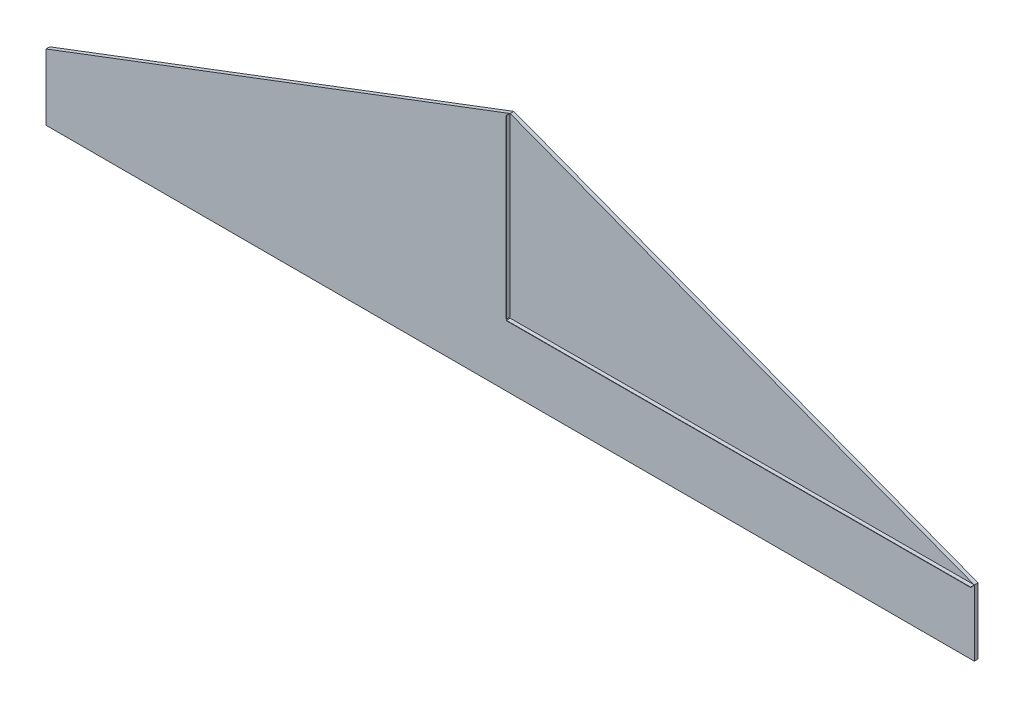
ISO-10303-21;
HEADER;
FILE_DESCRIPTION(('STEP AP214'),'2;1');
FILE_NAME('part.step','',(''),(''),'','','');
FILE_SCHEMA(('AUTOMOTIVE_DESIGN { 1 0 10303 214 1 1 1 1 }'));
ENDSEC;
DATA;
#1=APPLICATION_CONTEXT('core data for automotive mechanical design processes');
#2=APPLICATION_PROTOCOL_DEFINITION('international standard','automotive_design',2000,#1);
#3=PRODUCT_CONTEXT('',#1,'mechanical');
#4=PRODUCT('Part','Part','',(#3));
#5=PRODUCT_RELATED_PRODUCT_CATEGORY('part','',(#4));
#6=PRODUCT_DEFINITION_FORMATION('','',#4);
#7=PRODUCT_DEFINITION_CONTEXT('part definition',#1,'design');
#8=PRODUCT_DEFINITION('design','',#6,#7);
#9=PRODUCT_DEFINITION_SHAPE('','',#8);
#10=(LENGTH_UNIT() NAMED_UNIT(*) SI_UNIT(.MILLI.,.METRE.));
#11=(NAMED_UNIT(*) PLANE_ANGLE_UNIT() SI_UNIT($,.RADIAN.));
#12=(NAMED_UNIT(*) SI_UNIT($,.STERADIAN.) SOLID_ANGLE_UNIT());
#13=UNCERTAINTY_MEASURE_WITH_UNIT(LENGTH_MEASURE(1.E-05),#10,'distance_accuracy_value','');
#14=(GEOMETRIC_REPRESENTATION_CONTEXT(3) GLOBAL_UNCERTAINTY_ASSIGNED_CONTEXT((#13)) GLOBAL_UNIT_ASSIGNED_CONTEXT((#10,
#11,#12)) REPRESENTATION_CONTEXT('',''));
#15=CARTESIAN_POINT('',(0.,0.,0.));
#16=DIRECTION('',(0.,0.,1.));
#17=DIRECTION('',(1.,0.,0.));
#18=AXIS2_PLACEMENT_3D('',#15,#16,#17);
#19=CARTESIAN_POINT('',(0.,0.,100.));
#20=DIRECTION('',(0.,0.,1.));
#21=DIRECTION('',(1.,0.,0.));
#22=AXIS2_PLACEMENT_3D('',#19,#20,#21);
#23=PLANE('',#22);
#24=DIRECTION('',(0.,1.,0.));
#25=VECTOR('',#24,1.);
#26=CARTESIAN_POINT('',(12500.,0.,100.));
#27=LINE('',#26,#25);
#28=CARTESIAN_POINT('',(12500.,-1780.00000000001,100.));
#29=VERTEX_POINT('',#28);
#30=CARTESIAN_POINT('',(12500.,-10.0000275368477,100.));
#31=VERTEX_POINT('',#30);
#32=EDGE_CURVE('E244',#29,#31,#27,.T.);
#33=ORIENTED_EDGE('',*,*,#32,.T.);
#34=DIRECTION('',(0.99999724632281,0.00234677369979297,0.));
#35=VECTOR('',#34,1.);
#36=CARTESIAN_POINT('',(0.0234677369979297,-39.3347244890778,100.));
#37=LINE('',#36,#35);
#38=CARTESIAN_POINT('',(0.0234677369979297,-39.3347244890778,100.));
#39=VERTEX_POINT('',#38);
#40=EDGE_CURVE('E184',#39,#31,#37,.T.);
#41=ORIENTED_EDGE('',*,*,#40,.F.);
#42=DIRECTION('',(-0.00234677369979297,0.99999724632281,0.));
#43=VECTOR('',#42,1.);
#44=CARTESIAN_POINT('',(0.0234677369979297,-39.3347244890778,100.));
#45=LINE('',#44,#43);
#46=CARTESIAN_POINT('',(0.,-29.3347520258497,100.));
#47=VERTEX_POINT('',#46);
#48=EDGE_CURVE('E63',#39,#47,#45,.T.);
#49=ORIENTED_EDGE('',*,*,#48,.T.);
#50=DIRECTION('',(0.99999724632281,0.00234677369979297,0.));
#51=VECTOR('',#50,1.);
#52=CARTESIAN_POINT('',(0.,-29.3347520258497,100.));
#53=LINE('',#52,#51);
#54=CARTESIAN_POINT('',(12500.,0.,100.));
#55=VERTEX_POINT('',#54);
#56=EDGE_CURVE('E190',#47,#55,#53,.T.);
#57=ORIENTED_EDGE('',*,*,#56,.T.);
#58=DIRECTION('',(-0.93492894540015,0.354834985666526,0.));
#59=VECTOR('',#58,1.);
#60=CARTESIAN_POINT('',(12500.,0.,100.));
#61=LINE('',#60,#59);
#62=CARTESIAN_POINT('',(0.,4744.14375836146,100.));
#63=VERTEX_POINT('',#62);
#64=EDGE_CURVE('E247',#55,#63,#61,.T.);
#65=ORIENTED_EDGE('',*,*,#64,.T.);
#66=DIRECTION('',(0.,-1.,0.));
#67=VECTOR('',#66,1.);
#68=CARTESIAN_POINT('',(0.,4744.14375836146,100.));
#69=LINE('',#68,#67);
#70=CARTESIAN_POINT('',(0.,0.,100.));
#71=VERTEX_POINT('',#70);
#72=EDGE_CURVE('E225',#63,#71,#69,.T.);
#73=ORIENTED_EDGE('',*,*,#72,.T.);
#74=DIRECTION('',(-1.,0.,0.));
#75=VECTOR('',#74,1.);
#76=CARTESIAN_POINT('',(0.,0.,100.));
#77=LINE('',#76,#75);
#78=CARTESIAN_POINT('',(-10.,0.,100.));
#79=VERTEX_POINT('',#78);
#80=EDGE_CURVE('E221',#71,#79,#77,.T.);
#81=ORIENTED_EDGE('',*,*,#80,.T.);
#82=DIRECTION('',(0.,1.,0.));
#83=VECTOR('',#82,1.);
#84=CARTESIAN_POINT('',(-10.,4744.14375836146,100.));
#85=LINE('',#84,#83);
#86=CARTESIAN_POINT('',(-10.,4740.34844335477,100.));
#87=VERTEX_POINT('',#86);
#88=EDGE_CURVE('E11',#87,#79,#85,.F.);
#89=ORIENTED_EDGE('',*,*,#88,.F.);
#90=DIRECTION('',(-0.93492894540015,-0.354834985666526,0.));
#91=VECTOR('',#90,1.);
#92=CARTESIAN_POINT('',(0.,4744.14375836146,100.));
#93=LINE('',#92,#91);
#94=CARTESIAN_POINT('',(-12500.,0.,100.));
#95=VERTEX_POINT('',#94);
#96=EDGE_CURVE('E251',#87,#95,#93,.T.);
#97=ORIENTED_EDGE('',*,*,#96,.T.);
#98=DIRECTION('',(0.,-1.,0.));
#99=VECTOR('',#98,1.);
#100=CARTESIAN_POINT('',(-12500.,0.,100.));
#101=LINE('',#100,#99);
#102=CARTESIAN_POINT('',(-12500.,-1780.,100.));
#103=VERTEX_POINT('',#102);
#104=EDGE_CURVE('E255',#95,#103,#101,.T.);
#105=ORIENTED_EDGE('',*,*,#104,.T.);
#106=DIRECTION('',(1.,0.,0.));
#107=VECTOR('',#106,1.);
#108=CARTESIAN_POINT('',(-12500.,-1780.,100.));
#109=LINE('',#108,#107);
#110=EDGE_CURVE('E258',#103,#29,#109,.T.);
#111=ORIENTED_EDGE('',*,*,#110,.T.);
#112=EDGE_LOOP('',(#33,#41,#49,#57,#65,#73,#81,#89,#97,#105,#111));
#113=FACE_BOUND('',#112,.T.);
#114=ADVANCED_FACE('F45',(#113),#23,.T.);
#115=CARTESIAN_POINT('',(12500.,0.,100.));
#116=DIRECTION('',(-1.,0.,0.));
#117=DIRECTION('',(0.,0.,1.));
#118=AXIS2_PLACEMENT_3D('',#115,#116,#117);
#119=PLANE('',#118);
#120=DIRECTION('',(0.,1.,0.));
#121=VECTOR('',#120,1.);
#122=CARTESIAN_POINT('',(12500.,0.,0.));
#123=LINE('',#122,#121);
#124=CARTESIAN_POINT('',(12500.,-1780.00000000001,0.));
#125=VERTEX_POINT('',#124);
#126=CARTESIAN_POINT('',(12500.,0.,0.));
#127=VERTEX_POINT('',#126);
#128=EDGE_CURVE('E243',#125,#127,#123,.T.);
#129=ORIENTED_EDGE('',*,*,#128,.T.);
#130=DIRECTION('',(0.,0.,-1.));
#131=VECTOR('',#130,1.);
#132=CARTESIAN_POINT('',(12500.,0.,100.));
#133=LINE('',#132,#131);
#134=EDGE_CURVE('E49',#55,#127,#133,.T.);
#135=ORIENTED_EDGE('',*,*,#134,.F.);
#136=EDGE_CURVE('E71',#31,#55,#27,.T.);
#137=ORIENTED_EDGE('',*,*,#136,.F.);
#138=ORIENTED_EDGE('',*,*,#32,.F.);
#139=DIRECTION('',(0.,0.,-1.));
#140=VECTOR('',#139,1.);
#141=CARTESIAN_POINT('',(12500.,-1780.00000000001,100.));
#142=LINE('',#141,#140);
#143=EDGE_CURVE('E261',#29,#125,#142,.T.);
#144=ORIENTED_EDGE('',*,*,#143,.T.);
#145=EDGE_LOOP('',(#129,#135,#137,#138,#144));
#146=FACE_BOUND('',#145,.T.);
#147=ADVANCED_FACE('F47',(#146),#119,.F.);
#148=CARTESIAN_POINT('',(12500.,0.,100.));
#149=DIRECTION('',(-0.354834985666526,-0.93492894540015,0.));
#150=DIRECTION('',(0.93492894540015,-0.354834985666526,0.));
#151=AXIS2_PLACEMENT_3D('',#148,#149,#150);
#152=PLANE('',#151);
#153=DIRECTION('',(-0.93492894540015,0.354834985666526,0.));
#154=VECTOR('',#153,1.);
#155=CARTESIAN_POINT('',(12500.,0.,0.));
#156=LINE('',#155,#154);
#157=CARTESIAN_POINT('',(0.,4744.14375836146,0.));
#158=VERTEX_POINT('',#157);
#159=EDGE_CURVE('E265',#127,#158,#156,.T.);
#160=ORIENTED_EDGE('',*,*,#159,.T.);
#161=DIRECTION('',(0.,0.,-1.));
#162=VECTOR('',#161,1.);
#163=CARTESIAN_POINT('',(0.,4744.14375836146,100.));
#164=LINE('',#163,#162);
#165=EDGE_CURVE('E287',#63,#158,#164,.T.);
#166=ORIENTED_EDGE('',*,*,#165,.F.);
#167=ORIENTED_EDGE('',*,*,#64,.F.);
#168=ORIENTED_EDGE('',*,*,#134,.T.);
#169=EDGE_LOOP('',(#160,#166,#167,#168));
#170=FACE_BOUND('',#169,.T.);
#171=ADVANCED_FACE('F302',(#170),#152,.F.);
#172=CARTESIAN_POINT('',(0.,4744.14375836146,100.));
#173=DIRECTION('',(0.354834985666526,-0.93492894540015,0.));
#174=DIRECTION('',(0.93492894540015,0.354834985666526,0.));
#175=AXIS2_PLACEMENT_3D('',#172,#173,#174);
#176=PLANE('',#175);
#177=DIRECTION('',(-0.93492894540015,-0.354834985666526,0.));
#178=VECTOR('',#177,1.);
#179=CARTESIAN_POINT('',(0.,4744.14375836146,0.));
#180=LINE('',#179,#178);
#181=CARTESIAN_POINT('',(-12500.,0.,0.));
#182=VERTEX_POINT('',#181);
#183=EDGE_CURVE('E268',#158,#182,#180,.T.);
#184=ORIENTED_EDGE('',*,*,#183,.T.);
#185=DIRECTION('',(0.,0.,-1.));
#186=VECTOR('',#185,1.);
#187=CARTESIAN_POINT('',(-12500.,0.,100.));
#188=LINE('',#187,#186);
#189=EDGE_CURVE('E284',#95,#182,#188,.T.);
#190=ORIENTED_EDGE('',*,*,#189,.F.);
#191=ORIENTED_EDGE('',*,*,#96,.F.);
#192=EDGE_CURVE('E252',#63,#87,#93,.T.);
#193=ORIENTED_EDGE('',*,*,#192,.F.);
#194=ORIENTED_EDGE('',*,*,#165,.T.);
#195=EDGE_LOOP('',(#184,#190,#191,#193,#194));
#196=FACE_BOUND('',#195,.T.);
#197=ADVANCED_FACE('F310',(#196),#176,.F.);
#198=CARTESIAN_POINT('',(-12500.,0.,100.));
#199=DIRECTION('',(1.,0.,0.));
#200=DIRECTION('',(0.,0.,-1.));
#201=AXIS2_PLACEMENT_3D('',#198,#199,#200);
#202=PLANE('',#201);
#203=DIRECTION('',(0.,-1.,0.));
#204=VECTOR('',#203,1.);
#205=CARTESIAN_POINT('',(-12500.,0.,0.));
#206=LINE('',#205,#204);
#207=CARTESIAN_POINT('',(-12500.,-1780.,0.));
#208=VERTEX_POINT('',#207);
#209=EDGE_CURVE('E271',#182,#208,#206,.T.);
#210=ORIENTED_EDGE('',*,*,#209,.T.);
#211=DIRECTION('',(0.,0.,-1.));
#212=VECTOR('',#211,1.);
#213=CARTESIAN_POINT('',(-12500.,-1780.,100.));
#214=LINE('',#213,#212);
#215=EDGE_CURVE('E280',#103,#208,#214,.T.);
#216=ORIENTED_EDGE('',*,*,#215,.F.);
#217=ORIENTED_EDGE('',*,*,#104,.F.);
#218=ORIENTED_EDGE('',*,*,#189,.T.);
#219=EDGE_LOOP('',(#210,#216,#217,#218));
#220=FACE_BOUND('',#219,.T.);
#221=ADVANCED_FACE('F314',(#220),#202,.F.);
#222=CARTESIAN_POINT('',(-12500.,-1780.,100.));
#223=DIRECTION('',(0.,1.,0.));
#224=DIRECTION('',(-1.,0.,0.));
#225=AXIS2_PLACEMENT_3D('',#222,#223,#224);
#226=PLANE('',#225);
#227=DIRECTION('',(1.,0.,0.));
#228=VECTOR('',#227,1.);
#229=CARTESIAN_POINT('',(-12500.,-1780.,0.));
#230=LINE('',#229,#228);
#231=EDGE_CURVE('E274',#208,#125,#230,.T.);
#232=ORIENTED_EDGE('',*,*,#231,.T.);
#233=ORIENTED_EDGE('',*,*,#143,.F.);
#234=ORIENTED_EDGE('',*,*,#110,.F.);
#235=ORIENTED_EDGE('',*,*,#215,.T.);
#236=EDGE_LOOP('',(#232,#233,#234,#235));
#237=FACE_BOUND('',#236,.T.);
#238=ADVANCED_FACE('F421',(#237),#226,.F.);
#239=CARTESIAN_POINT('',(0.,0.,0.));
#240=DIRECTION('',(0.,0.,1.));
#241=DIRECTION('',(1.,0.,0.));
#242=AXIS2_PLACEMENT_3D('',#239,#240,#241);
#243=PLANE('',#242);
#244=ORIENTED_EDGE('',*,*,#128,.F.);
#245=ORIENTED_EDGE('',*,*,#231,.F.);
#246=ORIENTED_EDGE('',*,*,#209,.F.);
#247=ORIENTED_EDGE('',*,*,#183,.F.);
#248=ORIENTED_EDGE('',*,*,#159,.F.);
#249=EDGE_LOOP('',(#244,#245,#246,#247,#248));
#250=FACE_BOUND('',#249,.T.);
#251=ADVANCED_FACE('F307',(#250),#243,.F.);
#252=CARTESIAN_POINT('',(0.,0.,100.));
#253=DIRECTION('',(0.,0.,1.));
#254=DIRECTION('',(1.,0.,0.));
#255=AXIS2_PLACEMENT_3D('',#252,#253,#254);
#256=PLANE('',#255);
#257=DIRECTION('',(1.,0.,0.));
#258=VECTOR('',#257,1.);
#259=CARTESIAN_POINT('',(-10.,4744.14375836146,100.));
#260=LINE('',#259,#258);
#261=CARTESIAN_POINT('',(-10.,4744.14375836146,100.));
#262=VERTEX_POINT('',#261);
#263=EDGE_CURVE('E206',#262,#63,#260,.T.);
#264=ORIENTED_EDGE('',*,*,#263,.T.);
#265=ORIENTED_EDGE('',*,*,#192,.T.);
#266=EDGE_CURVE('E56',#262,#87,#85,.F.);
#267=ORIENTED_EDGE('',*,*,#266,.F.);
#268=EDGE_LOOP('',(#264,#265,#267));
#269=FACE_BOUND('',#268,.T.);
#270=ADVANCED_FACE('F420',(#269),#256,.F.);
#271=CARTESIAN_POINT('',(-10.,4744.14375836146,200.));
#272=DIRECTION('',(1.,0.,0.));
#273=DIRECTION('',(0.,0.,-1.));
#274=AXIS2_PLACEMENT_3D('',#271,#272,#273);
#275=PLANE('',#274);
#276=ORIENTED_EDGE('',*,*,#266,.T.);
#277=ORIENTED_EDGE('',*,*,#88,.T.);
#278=DIRECTION('',(0.,0.,-1.));
#279=VECTOR('',#278,1.);
#280=CARTESIAN_POINT('',(-10.,0.,200.));
#281=LINE('',#280,#279);
#282=CARTESIAN_POINT('',(-10.,0.,200.));
#283=VERTEX_POINT('',#282);
#284=EDGE_CURVE('E240',#283,#79,#281,.T.);
#285=ORIENTED_EDGE('',*,*,#284,.F.);
#286=DIRECTION('',(0.,1.,0.));
#287=VECTOR('',#286,1.);
#288=CARTESIAN_POINT('',(-10.,4744.14375836146,200.));
#289=LINE('',#288,#287);
#290=CARTESIAN_POINT('',(-10.,4744.14375836146,200.));
#291=VERTEX_POINT('',#290);
#292=EDGE_CURVE('E202',#291,#283,#289,.F.);
#293=ORIENTED_EDGE('',*,*,#292,.F.);
#294=DIRECTION('',(0.,0.,-1.));
#295=VECTOR('',#294,1.);
#296=CARTESIAN_POINT('',(-10.,4744.14375836146,200.));
#297=LINE('',#296,#295);
#298=EDGE_CURVE('E217',#291,#262,#297,.T.);
#299=ORIENTED_EDGE('',*,*,#298,.T.);
#300=EDGE_LOOP('',(#276,#277,#285,#293,#299));
#301=FACE_BOUND('',#300,.T.);
#302=ADVANCED_FACE('F416',(#301),#275,.F.);
#303=CARTESIAN_POINT('',(0.,0.,200.));
#304=DIRECTION('',(0.,-1.,0.));
#305=DIRECTION('',(0.,0.,-1.));
#306=AXIS2_PLACEMENT_3D('',#303,#304,#305);
#307=PLANE('',#306);
#308=ORIENTED_EDGE('',*,*,#80,.F.);
#309=DIRECTION('',(0.,0.,-1.));
#310=VECTOR('',#309,1.);
#311=CARTESIAN_POINT('',(0.,0.,200.));
#312=LINE('',#311,#310);
#313=CARTESIAN_POINT('',(0.,0.,200.));
#314=VERTEX_POINT('',#313);
#315=EDGE_CURVE('E237',#314,#71,#312,.T.);
#316=ORIENTED_EDGE('',*,*,#315,.F.);
#317=DIRECTION('',(-1.,0.,0.));
#318=VECTOR('',#317,1.);
#319=CARTESIAN_POINT('',(0.,0.,200.));
#320=LINE('',#319,#318);
#321=EDGE_CURVE('E205',#314,#283,#320,.T.);
#322=ORIENTED_EDGE('',*,*,#321,.T.);
#323=ORIENTED_EDGE('',*,*,#284,.T.);
#324=EDGE_LOOP('',(#308,#316,#322,#323));
#325=FACE_BOUND('',#324,.T.);
#326=ADVANCED_FACE('F462',(#325),#307,.T.);
#327=CARTESIAN_POINT('',(0.,4744.14375836146,200.));
#328=DIRECTION('',(1.,0.,0.));
#329=DIRECTION('',(0.,0.,-1.));
#330=AXIS2_PLACEMENT_3D('',#327,#328,#329);
#331=PLANE('',#330);
#332=ORIENTED_EDGE('',*,*,#72,.F.);
#333=DIRECTION('',(0.,0.,-1.));
#334=VECTOR('',#333,1.);
#335=CARTESIAN_POINT('',(0.,4744.14375836146,200.));
#336=LINE('',#335,#334);
#337=CARTESIAN_POINT('',(0.,4744.14375836146,200.));
#338=VERTEX_POINT('',#337);
#339=EDGE_CURVE('E234',#338,#63,#336,.T.);
#340=ORIENTED_EDGE('',*,*,#339,.F.);
#341=DIRECTION('',(0.,-1.,0.));
#342=VECTOR('',#341,1.);
#343=CARTESIAN_POINT('',(0.,4744.14375836146,200.));
#344=LINE('',#343,#342);
#345=EDGE_CURVE('E210',#338,#314,#344,.T.);
#346=ORIENTED_EDGE('',*,*,#345,.T.);
#347=ORIENTED_EDGE('',*,*,#315,.T.);
#348=EDGE_LOOP('',(#332,#340,#346,#347));
#349=FACE_BOUND('',#348,.T.);
#350=ADVANCED_FACE('F469',(#349),#331,.T.);
#351=CARTESIAN_POINT('',(-10.,4744.14375836146,200.));
#352=DIRECTION('',(0.,1.,0.));
#353=DIRECTION('',(0.,0.,1.));
#354=AXIS2_PLACEMENT_3D('',#351,#352,#353);
#355=PLANE('',#354);
#356=ORIENTED_EDGE('',*,*,#263,.F.);
#357=ORIENTED_EDGE('',*,*,#298,.F.);
#358=DIRECTION('',(1.,0.,0.));
#359=VECTOR('',#358,1.);
#360=CARTESIAN_POINT('',(-10.,4744.14375836146,200.));
#361=LINE('',#360,#359);
#362=EDGE_CURVE('E214',#291,#338,#361,.T.);
#363=ORIENTED_EDGE('',*,*,#362,.T.);
#364=ORIENTED_EDGE('',*,*,#339,.T.);
#365=EDGE_LOOP('',(#356,#357,#363,#364));
#366=FACE_BOUND('',#365,.T.);
#367=ADVANCED_FACE('F476',(#366),#355,.T.);
#368=CARTESIAN_POINT('',(0.,0.,200.));
#369=DIRECTION('',(0.,0.,1.));
#370=DIRECTION('',(1.,0.,0.));
#371=AXIS2_PLACEMENT_3D('',#368,#369,#370);
#372=PLANE('',#371);
#373=ORIENTED_EDGE('',*,*,#292,.T.);
#374=ORIENTED_EDGE('',*,*,#321,.F.);
#375=ORIENTED_EDGE('',*,*,#345,.F.);
#376=ORIENTED_EDGE('',*,*,#362,.F.);
#377=EDGE_LOOP('',(#373,#374,#375,#376));
#378=FACE_BOUND('',#377,.T.);
#379=ADVANCED_FACE('F484',(#378),#372,.T.);
#380=CARTESIAN_POINT('',(0.,0.,100.));
#381=DIRECTION('',(0.,0.,-1.));
#382=DIRECTION('',(-1.,0.,0.));
#383=AXIS2_PLACEMENT_3D('',#380,#381,#382);
#384=PLANE('',#383);
#385=ORIENTED_EDGE('',*,*,#136,.T.);
#386=DIRECTION('',(0.00234677369981284,-0.99999724632281,0.));
#387=VECTOR('',#386,1.);
#388=CARTESIAN_POINT('',(12500.,0.,100.));
#389=LINE('',#388,#387);
#390=CARTESIAN_POINT('',(12500.023467737,-9.9999724632281,100.));
#391=VERTEX_POINT('',#390);
#392=EDGE_CURVE('E187',#55,#391,#389,.T.);
#393=ORIENTED_EDGE('',*,*,#392,.T.);
#394=EDGE_CURVE('E164',#31,#391,#37,.T.);
#395=ORIENTED_EDGE('',*,*,#394,.F.);
#396=EDGE_LOOP('',(#385,#393,#395));
#397=FACE_BOUND('',#396,.T.);
#398=ADVANCED_FACE('F394',(#397),#384,.T.);
#399=CARTESIAN_POINT('',(0.0234677369979297,-39.3347244890778,200.));
#400=DIRECTION('',(-0.00234677369979297,0.99999724632281,0.));
#401=DIRECTION('',(-0.99999724632281,-0.00234677369979297,0.));
#402=AXIS2_PLACEMENT_3D('',#399,#400,#401);
#403=PLANE('',#402);
#404=ORIENTED_EDGE('',*,*,#40,.T.);
#405=ORIENTED_EDGE('',*,*,#394,.T.);
#406=DIRECTION('',(0.,0.,-1.));
#407=VECTOR('',#406,1.);
#408=CARTESIAN_POINT('',(12500.023467737,-9.9999724632281,200.));
#409=LINE('',#408,#407);
#410=CARTESIAN_POINT('',(12500.023467737,-9.9999724632281,200.));
#411=VERTEX_POINT('',#410);
#412=EDGE_CURVE('E160',#411,#391,#409,.T.);
#413=ORIENTED_EDGE('',*,*,#412,.F.);
#414=DIRECTION('',(0.99999724632281,0.00234677369979297,0.));
#415=VECTOR('',#414,1.);
#416=CARTESIAN_POINT('',(0.0234677369979297,-39.3347244890778,200.));
#417=LINE('',#416,#415);
#418=CARTESIAN_POINT('',(0.0234677369979297,-39.3347244890778,200.));
#419=VERTEX_POINT('',#418);
#420=EDGE_CURVE('E146',#419,#411,#417,.T.);
#421=ORIENTED_EDGE('',*,*,#420,.F.);
#422=DIRECTION('',(0.,0.,-1.));
#423=VECTOR('',#422,1.);
#424=CARTESIAN_POINT('',(0.0234677369979297,-39.3347244890778,200.));
#425=LINE('',#424,#423);
#426=EDGE_CURVE('E183',#419,#39,#425,.T.);
#427=ORIENTED_EDGE('',*,*,#426,.T.);
#428=EDGE_LOOP('',(#404,#405,#413,#421,#427));
#429=FACE_BOUND('',#428,.T.);
#430=ADVANCED_FACE('F162',(#429),#403,.F.);
#431=CARTESIAN_POINT('',(12500.,0.,200.));
#432=DIRECTION('',(0.99999724632281,0.00234677369981284,0.));
#433=DIRECTION('',(-0.00234677369981284,0.99999724632281,0.));
#434=AXIS2_PLACEMENT_3D('',#431,#432,#433);
#435=PLANE('',#434);
#436=ORIENTED_EDGE('',*,*,#392,.F.);
#437=DIRECTION('',(0.,0.,-1.));
#438=VECTOR('',#437,1.);
#439=CARTESIAN_POINT('',(12500.,0.,200.));
#440=LINE('',#439,#438);
#441=CARTESIAN_POINT('',(12500.,0.,200.));
#442=VERTEX_POINT('',#441);
#443=EDGE_CURVE('E169',#442,#55,#440,.T.);
#444=ORIENTED_EDGE('',*,*,#443,.F.);
#445=DIRECTION('',(0.00234677369981284,-0.99999724632281,0.));
#446=VECTOR('',#445,1.);
#447=CARTESIAN_POINT('',(12500.,0.,200.));
#448=LINE('',#447,#446);
#449=EDGE_CURVE('E151',#442,#411,#448,.T.);
#450=ORIENTED_EDGE('',*,*,#449,.T.);
#451=ORIENTED_EDGE('',*,*,#412,.T.);
#452=EDGE_LOOP('',(#436,#444,#450,#451));
#453=FACE_BOUND('',#452,.T.);
#454=ADVANCED_FACE('F171',(#453),#435,.T.);
#455=CARTESIAN_POINT('',(0.,-29.3347520258497,200.));
#456=DIRECTION('',(-0.00234677369979297,0.99999724632281,0.));
#457=DIRECTION('',(-0.99999724632281,-0.00234677369979297,0.));
#458=AXIS2_PLACEMENT_3D('',#455,#456,#457);
#459=PLANE('',#458);
#460=ORIENTED_EDGE('',*,*,#56,.F.);
#461=DIRECTION('',(0.,0.,-1.));
#462=VECTOR('',#461,1.);
#463=CARTESIAN_POINT('',(0.,-29.3347520258497,200.));
#464=LINE('',#463,#462);
#465=CARTESIAN_POINT('',(0.,-29.3347520258497,200.));
#466=VERTEX_POINT('',#465);
#467=EDGE_CURVE('E197',#466,#47,#464,.T.);
#468=ORIENTED_EDGE('',*,*,#467,.F.);
#469=DIRECTION('',(0.99999724632281,0.00234677369979297,0.));
#470=VECTOR('',#469,1.);
#471=CARTESIAN_POINT('',(0.,-29.3347520258497,200.));
#472=LINE('',#471,#470);
#473=EDGE_CURVE('E174',#466,#442,#472,.T.);
#474=ORIENTED_EDGE('',*,*,#473,.T.);
#475=ORIENTED_EDGE('',*,*,#443,.T.);
#476=EDGE_LOOP('',(#460,#468,#474,#475));
#477=FACE_BOUND('',#476,.T.);
#478=ADVANCED_FACE('F397',(#477),#459,.T.);
#479=CARTESIAN_POINT('',(0.0234677369979297,-39.3347244890778,200.));
#480=DIRECTION('',(-0.99999724632281,-0.00234677369979297,0.));
#481=DIRECTION('',(0.00234677369979297,-0.99999724632281,0.));
#482=AXIS2_PLACEMENT_3D('',#479,#480,#481);
#483=PLANE('',#482);
#484=ORIENTED_EDGE('',*,*,#48,.F.);
#485=ORIENTED_EDGE('',*,*,#426,.F.);
#486=DIRECTION('',(-0.00234677369979297,0.99999724632281,0.));
#487=VECTOR('',#486,1.);
#488=CARTESIAN_POINT('',(0.0234677369979297,-39.3347244890778,200.));
#489=LINE('',#488,#487);
#490=EDGE_CURVE('E154',#419,#466,#489,.T.);
#491=ORIENTED_EDGE('',*,*,#490,.T.);
#492=ORIENTED_EDGE('',*,*,#467,.T.);
#493=EDGE_LOOP('',(#484,#485,#491,#492));
#494=FACE_BOUND('',#493,.T.);
#495=ADVANCED_FACE('F399',(#494),#483,.T.);
#496=CARTESIAN_POINT('',(0.,0.,200.));
#497=DIRECTION('',(0.,0.,-1.));
#498=DIRECTION('',(-1.,0.,0.));
#499=AXIS2_PLACEMENT_3D('',#496,#497,#498);
#500=PLANE('',#499);
#501=ORIENTED_EDGE('',*,*,#420,.T.);
#502=ORIENTED_EDGE('',*,*,#449,.F.);
#503=ORIENTED_EDGE('',*,*,#473,.F.);
#504=ORIENTED_EDGE('',*,*,#490,.F.);
#505=EDGE_LOOP('',(#501,#502,#503,#504));
#506=FACE_BOUND('',#505,.T.);
#507=ADVANCED_FACE('F148',(#506),#500,.F.);
#508=CLOSED_SHELL('',(#114,#147,#171,#197,#221,#238,#251,#270,#302,#326,#350,#367,#379,#398,
#430,#454,#478,#495,#507));
#509=MANIFOLD_SOLID_BREP('B2',#508);
#510=ADVANCED_BREP_SHAPE_REPRESENTATION('',(#18,#509),#14);
#511=SHAPE_DEFINITION_REPRESENTATION(#9,#510);
ENDSEC;
END-ISO-10303-21;
